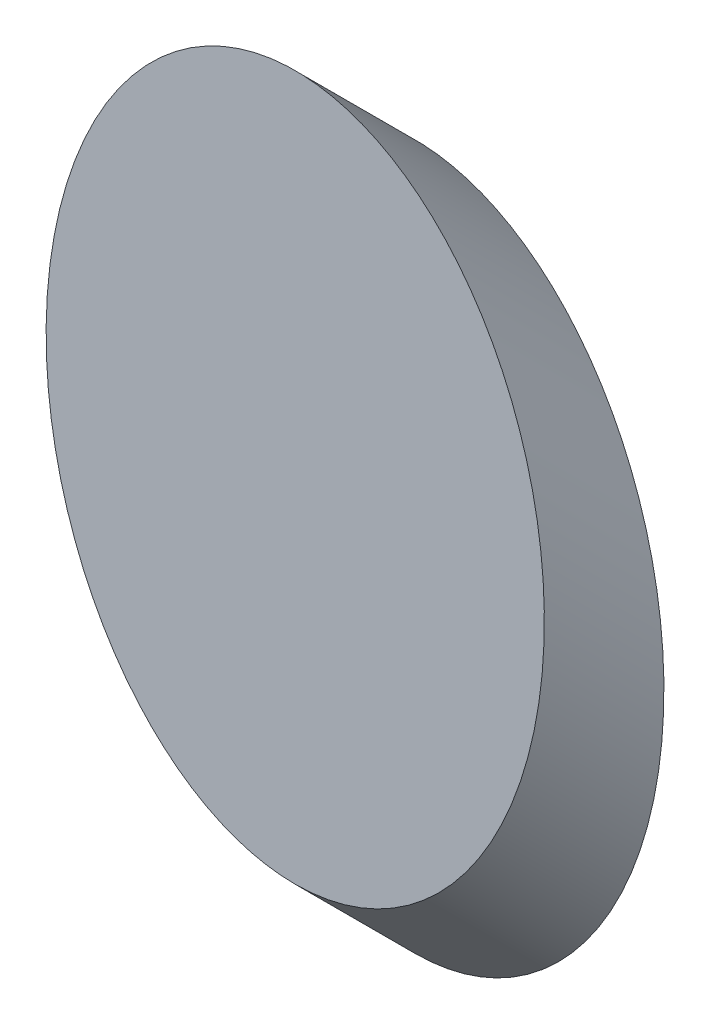
ISO-10303-21;
HEADER;
FILE_DESCRIPTION(('STEP AP214'),'2;1');
FILE_NAME('part.step','',(''),(''),'','','');
FILE_SCHEMA(('AUTOMOTIVE_DESIGN { 1 0 10303 214 1 1 1 1 }'));
ENDSEC;
DATA;
#1=APPLICATION_CONTEXT('core data for automotive mechanical design processes');
#2=APPLICATION_PROTOCOL_DEFINITION('international standard','automotive_design',2000,#1);
#3=PRODUCT_CONTEXT('',#1,'mechanical');
#4=PRODUCT('Part','Part','',(#3));
#5=PRODUCT_RELATED_PRODUCT_CATEGORY('part','',(#4));
#6=PRODUCT_DEFINITION_FORMATION('','',#4);
#7=PRODUCT_DEFINITION_CONTEXT('part definition',#1,'design');
#8=PRODUCT_DEFINITION('design','',#6,#7);
#9=PRODUCT_DEFINITION_SHAPE('','',#8);
#10=(LENGTH_UNIT() NAMED_UNIT(*) SI_UNIT(.MILLI.,.METRE.));
#11=(NAMED_UNIT(*) PLANE_ANGLE_UNIT() SI_UNIT($,.RADIAN.));
#12=(NAMED_UNIT(*) SI_UNIT($,.STERADIAN.) SOLID_ANGLE_UNIT());
#13=UNCERTAINTY_MEASURE_WITH_UNIT(LENGTH_MEASURE(1.E-05),#10,'distance_accuracy_value','');
#14=(GEOMETRIC_REPRESENTATION_CONTEXT(3) GLOBAL_UNCERTAINTY_ASSIGNED_CONTEXT((#13)) GLOBAL_UNIT_ASSIGNED_CONTEXT((#10,
#11,#12)) REPRESENTATION_CONTEXT('',''));
#15=CARTESIAN_POINT('',(0.,0.,0.));
#16=DIRECTION('',(0.,0.,1.));
#17=DIRECTION('',(1.,0.,0.));
#18=AXIS2_PLACEMENT_3D('',#15,#16,#17);
#19=CARTESIAN_POINT('',(54.3923829817161,29.7888583599199,-6.0000131704022));
#20=DIRECTION('',(0.,0.,1.));
#21=DIRECTION('',(0.,-1.,0.));
#22=AXIS2_PLACEMENT_3D('',#19,#20,#21);
#23=ELLIPSE('',#22,17.68,12.5);
#24=DIRECTION('',(0.,0.707106781186548,0.707106781186547));
#25=VECTOR('',#24,1.);
#26=SURFACE_OF_LINEAR_EXTRUSION('',#23,#25);
#27=CARTESIAN_POINT('',(54.3923829817161,12.1088583599199,-6.0000131704022));
#28=VERTEX_POINT('',#27);
#29=EDGE_CURVE('E10',#28,#28,#23,.T.);
#30=ORIENTED_EDGE('',*,*,#29,.T.);
#31=EDGE_LOOP('',(#30));
#32=FACE_BOUND('',#31,.T.);
#33=CARTESIAN_POINT('',(54.3923829817161,35.7888715303221,0.));
#34=DIRECTION('',(0.,0.,1.));
#35=DIRECTION('',(0.,-1.,0.));
#36=AXIS2_PLACEMENT_3D('',#33,#34,#35);
#37=ELLIPSE('',#36,17.68,12.5);
#38=CARTESIAN_POINT('',(54.3923829817161,18.1088715303221,0.));
#39=VERTEX_POINT('',#38);
#40=EDGE_CURVE('E39',#39,#39,#37,.T.);
#41=ORIENTED_EDGE('',*,*,#40,.F.);
#42=EDGE_LOOP('',(#41));
#43=FACE_BOUND('',#42,.T.);
#44=ADVANCED_FACE('F35',(#32,#43),#26,.T.);
#45=CARTESIAN_POINT('',(54.3923829817161,29.7888583599199,-6.0000131704022));
#46=DIRECTION('',(0.,0.,1.));
#47=DIRECTION('',(1.,0.,0.));
#48=AXIS2_PLACEMENT_3D('',#45,#46,#47);
#49=PLANE('',#48);
#50=ORIENTED_EDGE('',*,*,#29,.F.);
#51=EDGE_LOOP('',(#50));
#52=FACE_BOUND('',#51,.T.);
#53=ADVANCED_FACE('F51',(#52),#49,.F.);
#54=CARTESIAN_POINT('',(54.3923829817161,35.7888715303221,0.));
#55=DIRECTION('',(0.,0.,1.));
#56=DIRECTION('',(1.,0.,0.));
#57=AXIS2_PLACEMENT_3D('',#54,#55,#56);
#58=PLANE('',#57);
#59=ORIENTED_EDGE('',*,*,#40,.T.);
#60=EDGE_LOOP('',(#59));
#61=FACE_BOUND('',#60,.T.);
#62=ADVANCED_FACE('F48',(#61),#58,.T.);
#63=CLOSED_SHELL('',(#44,#53,#62));
#64=MANIFOLD_SOLID_BREP('B2',#63);
#65=ADVANCED_BREP_SHAPE_REPRESENTATION('',(#18,#64),#14);
#66=SHAPE_DEFINITION_REPRESENTATION(#9,#65);
ENDSEC;
END-ISO-10303-21;
